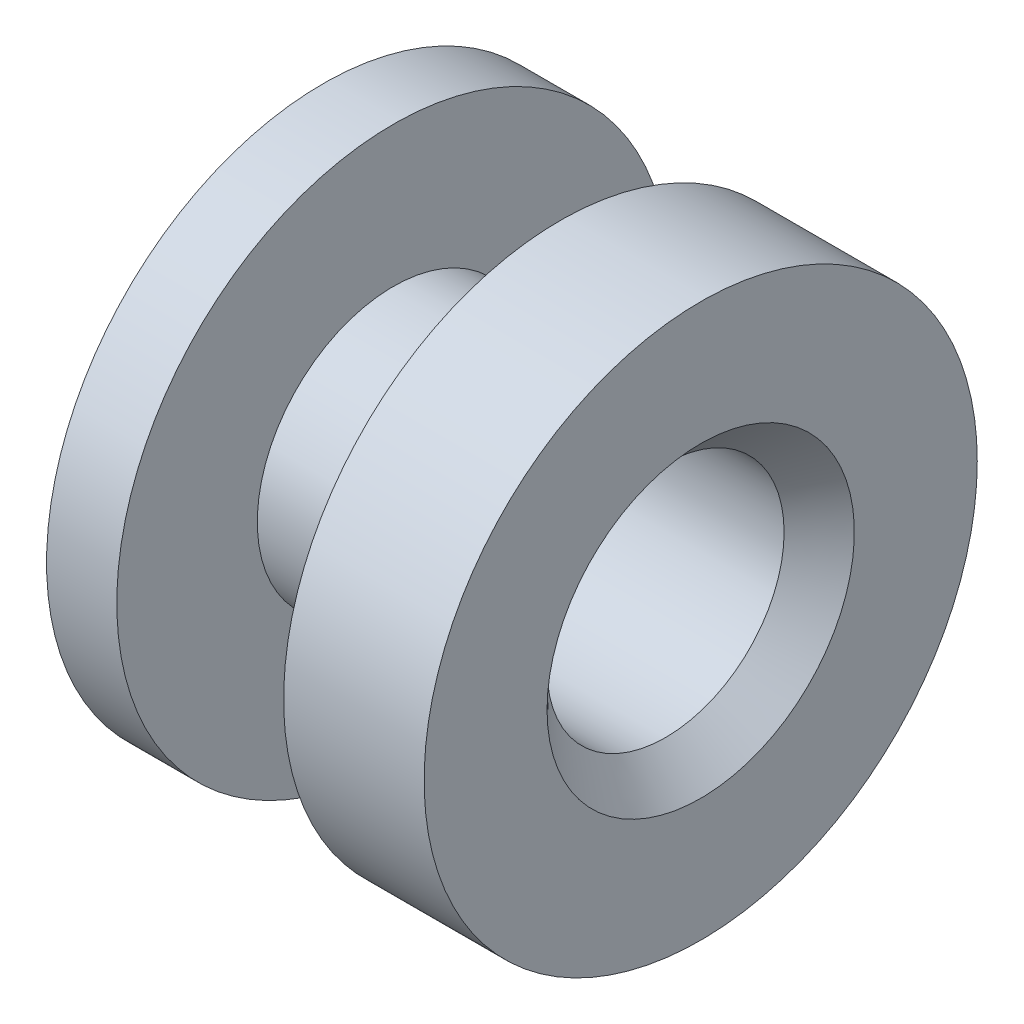
ISO-10303-21;
HEADER;
FILE_DESCRIPTION(('STEP AP214'),'2;1');
FILE_NAME('part.step','',(''),(''),'','','');
FILE_SCHEMA(('AUTOMOTIVE_DESIGN { 1 0 10303 214 1 1 1 1 }'));
ENDSEC;
DATA;
#1=APPLICATION_CONTEXT('core data for automotive mechanical design processes');
#2=APPLICATION_PROTOCOL_DEFINITION('international standard','automotive_design',2000,#1);
#3=PRODUCT_CONTEXT('',#1,'mechanical');
#4=PRODUCT('Part','Part','',(#3));
#5=PRODUCT_RELATED_PRODUCT_CATEGORY('part','',(#4));
#6=PRODUCT_DEFINITION_FORMATION('','',#4);
#7=PRODUCT_DEFINITION_CONTEXT('part definition',#1,'design');
#8=PRODUCT_DEFINITION('design','',#6,#7);
#9=PRODUCT_DEFINITION_SHAPE('','',#8);
#10=(LENGTH_UNIT() NAMED_UNIT(*) SI_UNIT(.MILLI.,.METRE.));
#11=(NAMED_UNIT(*) PLANE_ANGLE_UNIT() SI_UNIT($,.RADIAN.));
#12=(NAMED_UNIT(*) SI_UNIT($,.STERADIAN.) SOLID_ANGLE_UNIT());
#13=UNCERTAINTY_MEASURE_WITH_UNIT(LENGTH_MEASURE(1.E-05),#10,'distance_accuracy_value','');
#14=(GEOMETRIC_REPRESENTATION_CONTEXT(3) GLOBAL_UNCERTAINTY_ASSIGNED_CONTEXT((#13)) GLOBAL_UNIT_ASSIGNED_CONTEXT((#10,
#11,#12)) REPRESENTATION_CONTEXT('',''));
#15=CARTESIAN_POINT('',(0.,0.,0.));
#16=DIRECTION('',(0.,0.,1.));
#17=DIRECTION('',(1.,0.,0.));
#18=AXIS2_PLACEMENT_3D('',#15,#16,#17);
#19=CARTESIAN_POINT('',(10.922,0.,0.));
#20=DIRECTION('',(-1.,0.,0.));
#21=DIRECTION('',(0.,0.,1.));
#22=AXIS2_PLACEMENT_3D('',#19,#20,#21);
#23=PLANE('',#22);
#24=CARTESIAN_POINT('',(10.922,0.,0.));
#25=DIRECTION('',(-1.,0.,0.));
#26=DIRECTION('',(0.,0.,1.));
#27=AXIS2_PLACEMENT_3D('',#24,#25,#26);
#28=CIRCLE('',#27,4.44500000000001);
#29=CARTESIAN_POINT('',(10.922,0.,4.44500000000001));
#30=VERTEX_POINT('',#29);
#31=EDGE_CURVE('E10',#30,#30,#28,.T.);
#32=ORIENTED_EDGE('',*,*,#31,.T.);
#33=EDGE_LOOP('',(#32));
#34=FACE_BOUND('',#33,.T.);
#35=CARTESIAN_POINT('',(10.922,0.,0.));
#36=DIRECTION('',(1.,0.,0.));
#37=DIRECTION('',(0.,0.,-1.));
#38=AXIS2_PLACEMENT_3D('',#35,#36,#37);
#39=CIRCLE('',#38,8.001);
#40=CARTESIAN_POINT('',(10.922,0.,-8.001));
#41=VERTEX_POINT('',#40);
#42=EDGE_CURVE('E46',#41,#41,#39,.T.);
#43=ORIENTED_EDGE('',*,*,#42,.T.);
#44=EDGE_LOOP('',(#43));
#45=FACE_BOUND('',#44,.T.);
#46=ADVANCED_FACE('F34',(#34,#45),#23,.F.);
#47=CARTESIAN_POINT('',(10.922,0.,0.));
#48=DIRECTION('',(1.,0.,0.));
#49=DIRECTION('',(0.,0.,-1.));
#50=AXIS2_PLACEMENT_3D('',#47,#48,#49);
#51=CYLINDRICAL_SURFACE('',#50,8.001);
#52=ORIENTED_EDGE('',*,*,#42,.F.);
#53=EDGE_LOOP('',(#52));
#54=FACE_BOUND('',#53,.T.);
#55=CARTESIAN_POINT('',(6.858,0.,0.));
#56=DIRECTION('',(1.,0.,0.));
#57=DIRECTION('',(0.,0.,-1.));
#58=AXIS2_PLACEMENT_3D('',#55,#56,#57);
#59=CIRCLE('',#58,8.001);
#60=CARTESIAN_POINT('',(6.858,0.,-8.001));
#61=VERTEX_POINT('',#60);
#62=EDGE_CURVE('E50',#61,#61,#59,.T.);
#63=ORIENTED_EDGE('',*,*,#62,.T.);
#64=EDGE_LOOP('',(#63));
#65=FACE_BOUND('',#64,.T.);
#66=ADVANCED_FACE('F85',(#54,#65),#51,.T.);
#67=CARTESIAN_POINT('',(6.858,0.,0.));
#68=DIRECTION('',(1.,0.,0.));
#69=DIRECTION('',(0.,0.,-1.));
#70=AXIS2_PLACEMENT_3D('',#67,#68,#69);
#71=PLANE('',#70);
#72=ORIENTED_EDGE('',*,*,#62,.F.);
#73=EDGE_LOOP('',(#72));
#74=FACE_BOUND('',#73,.T.);
#75=CARTESIAN_POINT('',(6.858,0.,0.));
#76=DIRECTION('',(1.,0.,0.));
#77=DIRECTION('',(0.,0.,-1.));
#78=AXIS2_PLACEMENT_3D('',#75,#76,#77);
#79=CIRCLE('',#78,3.937);
#80=CARTESIAN_POINT('',(6.858,0.,-3.937));
#81=VERTEX_POINT('',#80);
#82=EDGE_CURVE('E55',#81,#81,#79,.T.);
#83=ORIENTED_EDGE('',*,*,#82,.T.);
#84=EDGE_LOOP('',(#83));
#85=FACE_BOUND('',#84,.T.);
#86=ADVANCED_FACE('F89',(#74,#85),#71,.F.);
#87=CARTESIAN_POINT('',(10.922,0.,0.));
#88=DIRECTION('',(1.,0.,0.));
#89=DIRECTION('',(0.,0.,-1.));
#90=AXIS2_PLACEMENT_3D('',#87,#88,#89);
#91=CYLINDRICAL_SURFACE('',#90,3.937);
#92=ORIENTED_EDGE('',*,*,#82,.F.);
#93=EDGE_LOOP('',(#92));
#94=FACE_BOUND('',#93,.T.);
#95=CARTESIAN_POINT('',(2.032,0.,0.));
#96=DIRECTION('',(1.,0.,0.));
#97=DIRECTION('',(0.,0.,-1.));
#98=AXIS2_PLACEMENT_3D('',#95,#96,#97);
#99=CIRCLE('',#98,3.937);
#100=CARTESIAN_POINT('',(2.032,0.,-3.937));
#101=VERTEX_POINT('',#100);
#102=EDGE_CURVE('E58',#101,#101,#99,.T.);
#103=ORIENTED_EDGE('',*,*,#102,.T.);
#104=EDGE_LOOP('',(#103));
#105=FACE_BOUND('',#104,.T.);
#106=ADVANCED_FACE('F96',(#94,#105),#91,.T.);
#107=CARTESIAN_POINT('',(2.032,0.,0.));
#108=DIRECTION('',(-1.,0.,0.));
#109=DIRECTION('',(0.,0.,1.));
#110=AXIS2_PLACEMENT_3D('',#107,#108,#109);
#111=PLANE('',#110);
#112=ORIENTED_EDGE('',*,*,#102,.F.);
#113=EDGE_LOOP('',(#112));
#114=FACE_BOUND('',#113,.T.);
#115=CARTESIAN_POINT('',(2.032,0.,0.));
#116=DIRECTION('',(1.,0.,0.));
#117=DIRECTION('',(0.,0.,-1.));
#118=AXIS2_PLACEMENT_3D('',#115,#116,#117);
#119=CIRCLE('',#118,8.001);
#120=CARTESIAN_POINT('',(2.032,0.,-8.001));
#121=VERTEX_POINT('',#120);
#122=EDGE_CURVE('E61',#121,#121,#119,.T.);
#123=ORIENTED_EDGE('',*,*,#122,.T.);
#124=EDGE_LOOP('',(#123));
#125=FACE_BOUND('',#124,.T.);
#126=ADVANCED_FACE('F100',(#114,#125),#111,.F.);
#127=CARTESIAN_POINT('',(10.922,0.,0.));
#128=DIRECTION('',(1.,0.,0.));
#129=DIRECTION('',(0.,0.,-1.));
#130=AXIS2_PLACEMENT_3D('',#127,#128,#129);
#131=CYLINDRICAL_SURFACE('',#130,8.001);
#132=ORIENTED_EDGE('',*,*,#122,.F.);
#133=EDGE_LOOP('',(#132));
#134=FACE_BOUND('',#133,.T.);
#135=CARTESIAN_POINT('',(0.,0.,0.));
#136=DIRECTION('',(1.,0.,0.));
#137=DIRECTION('',(0.,0.,-1.));
#138=AXIS2_PLACEMENT_3D('',#135,#136,#137);
#139=CIRCLE('',#138,8.001);
#140=CARTESIAN_POINT('',(0.,0.,-8.001));
#141=VERTEX_POINT('',#140);
#142=EDGE_CURVE('E64',#141,#141,#139,.T.);
#143=ORIENTED_EDGE('',*,*,#142,.T.);
#144=EDGE_LOOP('',(#143));
#145=FACE_BOUND('',#144,.T.);
#146=ADVANCED_FACE('F82',(#134,#145),#131,.T.);
#147=CARTESIAN_POINT('',(0.,0.,0.));
#148=DIRECTION('',(1.,0.,0.));
#149=DIRECTION('',(0.,0.,-1.));
#150=AXIS2_PLACEMENT_3D('',#147,#148,#149);
#151=PLANE('',#150);
#152=CARTESIAN_POINT('',(0.,0.,0.));
#153=DIRECTION('',(1.,0.,0.));
#154=DIRECTION('',(0.,0.,-1.));
#155=AXIS2_PLACEMENT_3D('',#152,#153,#154);
#156=CIRCLE('',#155,3.429);
#157=CARTESIAN_POINT('',(0.,0.,-3.429));
#158=VERTEX_POINT('',#157);
#159=EDGE_CURVE('E67',#158,#158,#156,.T.);
#160=ORIENTED_EDGE('',*,*,#159,.T.);
#161=EDGE_LOOP('',(#160));
#162=FACE_BOUND('',#161,.T.);
#163=ORIENTED_EDGE('',*,*,#142,.F.);
#164=EDGE_LOOP('',(#163));
#165=FACE_BOUND('',#164,.T.);
#166=ADVANCED_FACE('F71',(#162,#165),#151,.F.);
#167=CARTESIAN_POINT('',(0.,0.,0.));
#168=DIRECTION('',(1.,0.,0.));
#169=DIRECTION('',(0.,0.,-1.));
#170=AXIS2_PLACEMENT_3D('',#167,#168,#169);
#171=CYLINDRICAL_SURFACE('',#170,3.429);
#172=CARTESIAN_POINT('',(9.90599999999999,0.,0.));
#173=DIRECTION('',(-1.,0.,0.));
#174=DIRECTION('',(0.,0.,1.));
#175=AXIS2_PLACEMENT_3D('',#172,#173,#174);
#176=CIRCLE('',#175,3.429);
#177=CARTESIAN_POINT('',(9.90599999999999,0.,3.429));
#178=VERTEX_POINT('',#177);
#179=EDGE_CURVE('E42',#178,#178,#176,.F.);
#180=ORIENTED_EDGE('',*,*,#179,.T.);
#181=EDGE_LOOP('',(#180));
#182=FACE_BOUND('',#181,.T.);
#183=ORIENTED_EDGE('',*,*,#159,.F.);
#184=EDGE_LOOP('',(#183));
#185=FACE_BOUND('',#184,.T.);
#186=ADVANCED_FACE('F74',(#182,#185),#171,.F.);
#187=CARTESIAN_POINT('',(9.90599999999999,0.,0.));
#188=DIRECTION('',(1.,0.,0.));
#189=DIRECTION('',(0.,0.,-1.));
#190=AXIS2_PLACEMENT_3D('',#187,#188,#189);
#191=CONICAL_SURFACE('',#190,3.429,0.785398163397449);
#192=ORIENTED_EDGE('',*,*,#31,.F.);
#193=EDGE_LOOP('',(#192));
#194=FACE_BOUND('',#193,.T.);
#195=ORIENTED_EDGE('',*,*,#179,.F.);
#196=EDGE_LOOP('',(#195));
#197=FACE_BOUND('',#196,.T.);
#198=ADVANCED_FACE('F37',(#194,#197),#191,.F.);
#199=CLOSED_SHELL('',(#46,#66,#86,#106,#126,#146,#166,#186,#198));
#200=MANIFOLD_SOLID_BREP('B2',#199);
#201=ADVANCED_BREP_SHAPE_REPRESENTATION('',(#18,#200),#14);
#202=SHAPE_DEFINITION_REPRESENTATION(#9,#201);
ENDSEC;
END-ISO-10303-21;
